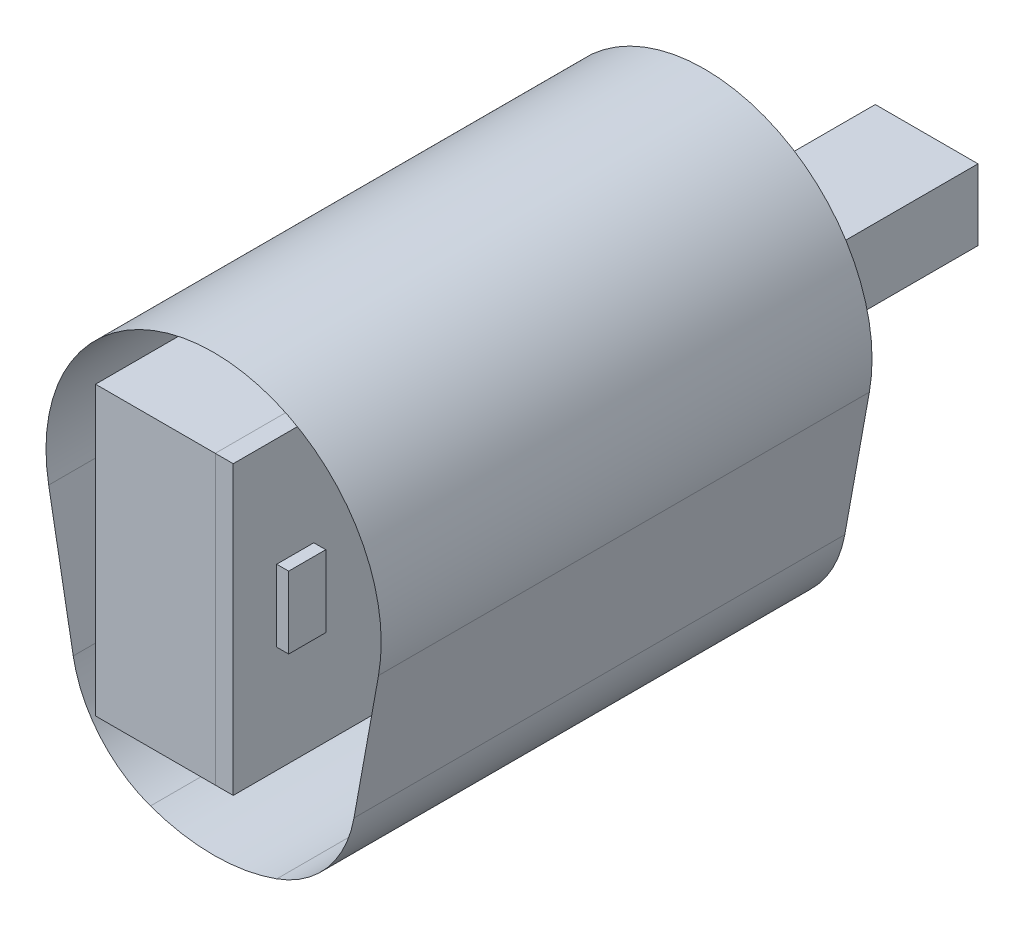
ISO-10303-21;
HEADER;
FILE_DESCRIPTION(('STEP AP214'),'2;1');
FILE_NAME('part.step','',(''),(''),'','','');
FILE_SCHEMA(('AUTOMOTIVE_DESIGN { 1 0 10303 214 1 1 1 1 }'));
ENDSEC;
DATA;
#1=APPLICATION_CONTEXT('core data for automotive mechanical design processes');
#2=APPLICATION_PROTOCOL_DEFINITION('international standard','automotive_design',2000,#1);
#3=PRODUCT_CONTEXT('',#1,'mechanical');
#4=PRODUCT('Part','Part','',(#3));
#5=PRODUCT_RELATED_PRODUCT_CATEGORY('part','',(#4));
#6=PRODUCT_DEFINITION_FORMATION('','',#4);
#7=PRODUCT_DEFINITION_CONTEXT('part definition',#1,'design');
#8=PRODUCT_DEFINITION('design','',#6,#7);
#9=PRODUCT_DEFINITION_SHAPE('','',#8);
#10=(LENGTH_UNIT() NAMED_UNIT(*) SI_UNIT(.MILLI.,.METRE.));
#11=(NAMED_UNIT(*) PLANE_ANGLE_UNIT() SI_UNIT($,.RADIAN.));
#12=(NAMED_UNIT(*) SI_UNIT($,.STERADIAN.) SOLID_ANGLE_UNIT());
#13=UNCERTAINTY_MEASURE_WITH_UNIT(LENGTH_MEASURE(1.E-05),#10,'distance_accuracy_value','');
#14=(GEOMETRIC_REPRESENTATION_CONTEXT(3) GLOBAL_UNCERTAINTY_ASSIGNED_CONTEXT((#13)) GLOBAL_UNIT_ASSIGNED_CONTEXT((#10,
#11,#12)) REPRESENTATION_CONTEXT('',''));
#15=CARTESIAN_POINT('',(0.,0.,0.));
#16=DIRECTION('',(0.,0.,1.));
#17=DIRECTION('',(1.,0.,0.));
#18=AXIS2_PLACEMENT_3D('',#15,#16,#17);
#19=CARTESIAN_POINT('',(5.87335845176571,17.7664865534949,-10.0873183230166));
#20=DIRECTION('',(0.,0.,-1.));
#21=DIRECTION('',(-1.,0.,0.));
#22=AXIS2_PLACEMENT_3D('',#19,#20,#21);
#23=CYLINDRICAL_SURFACE('',#22,5.);
#24=CARTESIAN_POINT('',(5.87335845176571,17.7664865534949,-30.5873183230166));
#25=DIRECTION('',(0.,0.,1.));
#26=DIRECTION('',(-1.,0.,0.));
#27=AXIS2_PLACEMENT_3D('',#24,#25,#26);
#28=CIRCLE('',#27,5.);
#29=CARTESIAN_POINT('',(7.56837223879699,13.06255965549,-30.5873183230166));
#30=VERTEX_POINT('',#29);
#31=CARTESIAN_POINT('',(10.7934731968402,16.8762782097346,-30.5873183230166));
#32=VERTEX_POINT('',#31);
#33=EDGE_CURVE('E56',#30,#32,#28,.T.);
#34=ORIENTED_EDGE('',*,*,#33,.F.);
#35=DIRECTION('',(0.,0.,-1.));
#36=VECTOR('',#35,1.);
#37=CARTESIAN_POINT('',(7.56837223879699,13.06255965549,-10.0873183230166));
#38=LINE('',#37,#36);
#39=CARTESIAN_POINT('',(7.56837223879699,13.06255965549,-10.0873183230166));
#40=VERTEX_POINT('',#39);
#41=EDGE_CURVE('E64',#40,#30,#38,.T.);
#42=ORIENTED_EDGE('',*,*,#41,.F.);
#43=CARTESIAN_POINT('',(5.87335845176571,17.7664865534949,-10.0873183230166));
#44=DIRECTION('',(0.,0.,1.));
#45=DIRECTION('',(-1.,0.,0.));
#46=AXIS2_PLACEMENT_3D('',#43,#44,#45);
#47=CIRCLE('',#46,5.);
#48=CARTESIAN_POINT('',(10.7934731968402,16.8762782097346,-10.0873183230166));
#49=VERTEX_POINT('',#48);
#50=EDGE_CURVE('E12',#40,#49,#47,.T.);
#51=ORIENTED_EDGE('',*,*,#50,.T.);
#52=DIRECTION('',(0.,0.,-1.));
#53=VECTOR('',#52,1.);
#54=CARTESIAN_POINT('',(10.7934731968402,16.8762782097346,-10.0873183230166));
#55=LINE('',#54,#53);
#56=EDGE_CURVE('E50',#49,#32,#55,.T.);
#57=ORIENTED_EDGE('',*,*,#56,.T.);
#58=EDGE_LOOP('',(#34,#42,#51,#57));
#59=FACE_BOUND('',#58,.T.);
#60=ADVANCED_FACE('F48',(#59),#23,.F.);
#61=CARTESIAN_POINT('',(10.7934731968402,16.8762782097346,-10.0873183230166));
#62=DIRECTION('',(-0.984022949014901,0.178041668752059,0.));
#63=DIRECTION('',(-0.178041668752059,-0.984022949014901,0.));
#64=AXIS2_PLACEMENT_3D('',#61,#62,#63);
#65=PLANE('',#64);
#66=DIRECTION('',(0.178041668752059,0.984022949014901,0.));
#67=VECTOR('',#66,1.);
#68=CARTESIAN_POINT('',(10.7934731968402,16.8762782097346,-30.5873183230166));
#69=LINE('',#68,#67);
#70=CARTESIAN_POINT('',(11.8189197951428,22.5438446439957,-30.5873183230166));
#71=VERTEX_POINT('',#70);
#72=EDGE_CURVE('E138',#32,#71,#69,.T.);
#73=ORIENTED_EDGE('',*,*,#72,.F.);
#74=ORIENTED_EDGE('',*,*,#56,.F.);
#75=DIRECTION('',(0.178041668752059,0.984022949014901,0.));
#76=VECTOR('',#75,1.);
#77=CARTESIAN_POINT('',(10.7934731968402,16.8762782097346,-10.0873183230166));
#78=LINE('',#77,#76);
#79=CARTESIAN_POINT('',(11.8189197951428,22.5438446439957,-10.0873183230166));
#80=VERTEX_POINT('',#79);
#81=EDGE_CURVE('E152',#49,#80,#78,.T.);
#82=ORIENTED_EDGE('',*,*,#81,.T.);
#83=DIRECTION('',(0.,0.,-1.));
#84=VECTOR('',#83,1.);
#85=CARTESIAN_POINT('',(11.8189197951428,22.5438446439957,-10.0873183230166));
#86=LINE('',#85,#84);
#87=EDGE_CURVE('E132',#80,#71,#86,.T.);
#88=ORIENTED_EDGE('',*,*,#87,.T.);
#89=EDGE_LOOP('',(#73,#74,#82,#88));
#90=FACE_BOUND('',#89,.T.);
#91=ADVANCED_FACE('F166',(#90),#65,.T.);
#92=CARTESIAN_POINT('',(4.93075915203847,23.7901363252601,-10.0873183230166));
#93=DIRECTION('',(0.,0.,-1.));
#94=DIRECTION('',(-1.,0.,0.));
#95=AXIS2_PLACEMENT_3D('',#92,#93,#94);
#96=CYLINDRICAL_SURFACE('',#95,7.);
#97=CARTESIAN_POINT('',(4.93075915203847,23.7901363252601,-30.5873183230166));
#98=DIRECTION('',(0.,0.,1.));
#99=DIRECTION('',(1.,0.,0.));
#100=AXIS2_PLACEMENT_3D('',#97,#98,#99);
#101=CIRCLE('',#100,7.);
#102=CARTESIAN_POINT('',(-1.95740149106583,22.5438446439957,-30.5873183230166));
#103=VERTEX_POINT('',#102);
#104=EDGE_CURVE('E125',#71,#103,#101,.T.);
#105=ORIENTED_EDGE('',*,*,#104,.F.);
#106=ORIENTED_EDGE('',*,*,#87,.F.);
#107=CARTESIAN_POINT('',(4.93075915203847,23.7901363252601,-10.0873183230166));
#108=DIRECTION('',(0.,0.,1.));
#109=DIRECTION('',(1.,0.,0.));
#110=AXIS2_PLACEMENT_3D('',#107,#108,#109);
#111=CIRCLE('',#110,7.);
#112=CARTESIAN_POINT('',(-1.95740149106583,22.5438446439957,-10.0873183230166));
#113=VERTEX_POINT('',#112);
#114=EDGE_CURVE('E141',#80,#113,#111,.T.);
#115=ORIENTED_EDGE('',*,*,#114,.T.);
#116=DIRECTION('',(0.,0.,-1.));
#117=VECTOR('',#116,1.);
#118=CARTESIAN_POINT('',(-1.95740149106583,22.5438446439957,-10.0873183230166));
#119=LINE('',#118,#117);
#120=EDGE_CURVE('E122',#113,#103,#119,.T.);
#121=ORIENTED_EDGE('',*,*,#120,.T.);
#122=EDGE_LOOP('',(#105,#106,#115,#121));
#123=FACE_BOUND('',#122,.T.);
#124=ADVANCED_FACE('F168',(#123),#96,.F.);
#125=CARTESIAN_POINT('',(-0.931954892763262,16.8762782097346,-10.0873183230166));
#126=DIRECTION('',(0.984022949014901,0.17804166875206,0.));
#127=DIRECTION('',(-0.17804166875206,0.984022949014901,0.));
#128=AXIS2_PLACEMENT_3D('',#125,#126,#127);
#129=PLANE('',#128);
#130=DIRECTION('',(0.17804166875206,-0.984022949014901,0.));
#131=VECTOR('',#130,1.);
#132=CARTESIAN_POINT('',(-0.931954892763262,16.8762782097346,-30.5873183230166));
#133=LINE('',#132,#131);
#134=CARTESIAN_POINT('',(-0.931954892763262,16.8762782097346,-30.5873183230166));
#135=VERTEX_POINT('',#134);
#136=EDGE_CURVE('E117',#103,#135,#133,.T.);
#137=ORIENTED_EDGE('',*,*,#136,.F.);
#138=ORIENTED_EDGE('',*,*,#120,.F.);
#139=DIRECTION('',(0.17804166875206,-0.984022949014901,0.));
#140=VECTOR('',#139,1.);
#141=CARTESIAN_POINT('',(-0.931954892763262,16.8762782097346,-10.0873183230166));
#142=LINE('',#141,#140);
#143=CARTESIAN_POINT('',(-0.931954892763262,16.8762782097346,-10.0873183230166));
#144=VERTEX_POINT('',#143);
#145=EDGE_CURVE('E120',#113,#144,#142,.T.);
#146=ORIENTED_EDGE('',*,*,#145,.T.);
#147=DIRECTION('',(0.,0.,-1.));
#148=VECTOR('',#147,1.);
#149=CARTESIAN_POINT('',(-0.931954892763262,16.8762782097346,-10.0873183230166));
#150=LINE('',#149,#148);
#151=EDGE_CURVE('E105',#144,#135,#150,.T.);
#152=ORIENTED_EDGE('',*,*,#151,.T.);
#153=EDGE_LOOP('',(#137,#138,#146,#152));
#154=FACE_BOUND('',#153,.T.);
#155=ADVANCED_FACE('F121',(#154),#129,.T.);
#156=CARTESIAN_POINT('',(3.98815985231124,17.7664865534949,-10.0873183230166));
#157=DIRECTION('',(0.,0.,-1.));
#158=DIRECTION('',(-1.,0.,0.));
#159=AXIS2_PLACEMENT_3D('',#156,#157,#158);
#160=CYLINDRICAL_SURFACE('',#159,5.);
#161=CARTESIAN_POINT('',(3.98815985231124,17.7664865534949,-30.5873183230166));
#162=DIRECTION('',(0.,0.,1.));
#163=DIRECTION('',(1.,0.,0.));
#164=AXIS2_PLACEMENT_3D('',#161,#162,#163);
#165=CIRCLE('',#164,5.);
#166=CARTESIAN_POINT('',(2.29314606527996,13.06255965549,-30.5873183230166));
#167=VERTEX_POINT('',#166);
#168=EDGE_CURVE('E110',#135,#167,#165,.T.);
#169=ORIENTED_EDGE('',*,*,#168,.F.);
#170=ORIENTED_EDGE('',*,*,#151,.F.);
#171=CARTESIAN_POINT('',(3.98815985231124,17.7664865534949,-10.0873183230166));
#172=DIRECTION('',(0.,0.,1.));
#173=DIRECTION('',(1.,0.,0.));
#174=AXIS2_PLACEMENT_3D('',#171,#172,#173);
#175=CIRCLE('',#174,5.);
#176=CARTESIAN_POINT('',(2.29314606527996,13.06255965549,-10.0873183230166));
#177=VERTEX_POINT('',#176);
#178=EDGE_CURVE('E108',#144,#177,#175,.T.);
#179=ORIENTED_EDGE('',*,*,#178,.T.);
#180=DIRECTION('',(0.,0.,-1.));
#181=VECTOR('',#180,1.);
#182=CARTESIAN_POINT('',(2.29314606527996,13.06255965549,-10.0873183230166));
#183=LINE('',#182,#181);
#184=EDGE_CURVE('E87',#177,#167,#183,.T.);
#185=ORIENTED_EDGE('',*,*,#184,.T.);
#186=EDGE_LOOP('',(#169,#170,#179,#185));
#187=FACE_BOUND('',#186,.T.);
#188=ADVANCED_FACE('F107',(#187),#160,.F.);
#189=CARTESIAN_POINT('',(4.93075915203847,20.3823462202138,-10.0873183230166));
#190=DIRECTION('',(0.,0.,-1.));
#191=DIRECTION('',(-1.,0.,0.));
#192=AXIS2_PLACEMENT_3D('',#189,#190,#191);
#193=CYLINDRICAL_SURFACE('',#192,7.78050629127371);
#194=CARTESIAN_POINT('',(4.93075915203847,20.3823462202138,-30.5873183230166));
#195=DIRECTION('',(0.,0.,1.));
#196=DIRECTION('',(1.,0.,0.));
#197=AXIS2_PLACEMENT_3D('',#194,#195,#196);
#198=CIRCLE('',#197,7.78050629127371);
#199=EDGE_CURVE('E145',#167,#30,#198,.T.);
#200=ORIENTED_EDGE('',*,*,#199,.F.);
#201=ORIENTED_EDGE('',*,*,#184,.F.);
#202=CARTESIAN_POINT('',(4.93075915203847,20.3823462202138,-10.0873183230166));
#203=DIRECTION('',(0.,0.,1.));
#204=DIRECTION('',(1.,0.,0.));
#205=AXIS2_PLACEMENT_3D('',#202,#203,#204);
#206=CIRCLE('',#205,7.78050629127371);
#207=EDGE_CURVE('E136',#177,#40,#206,.T.);
#208=ORIENTED_EDGE('',*,*,#207,.T.);
#209=ORIENTED_EDGE('',*,*,#41,.T.);
#210=EDGE_LOOP('',(#200,#201,#208,#209));
#211=FACE_BOUND('',#210,.T.);
#212=ADVANCED_FACE('F179',(#211),#193,.F.);
#213=OPEN_SHELL('',(#60,#91,#124,#155,#188,#212));
#214=SHELL_BASED_SURFACE_MODEL('B2',(#213));
#215=CARTESIAN_POINT('',(6.25,22.6273289046221,-11.9028565326466));
#216=DIRECTION('',(0.,0.,-1.));
#217=DIRECTION('',(-1.,0.,0.));
#218=AXIS2_PLACEMENT_3D('',#215,#216,#217);
#219=PLANE('',#218);
#220=DIRECTION('',(0.,-1.,0.));
#221=VECTOR('',#220,1.);
#222=CARTESIAN_POINT('',(5.75,22.6273289046221,-11.9028565326466));
#223=LINE('',#222,#221);
#224=CARTESIAN_POINT('',(5.75,22.6273289046221,-11.9028565326466));
#225=VERTEX_POINT('',#224);
#226=CARTESIAN_POINT('',(5.75,19.6273289046221,-11.9028565326466));
#227=VERTEX_POINT('',#226);
#228=EDGE_CURVE('E311',#225,#227,#223,.T.);
#229=ORIENTED_EDGE('',*,*,#228,.T.);
#230=DIRECTION('',(-1.,0.,0.));
#231=VECTOR('',#230,1.);
#232=CARTESIAN_POINT('',(6.25,19.6273289046221,-11.9028565326466));
#233=LINE('',#232,#231);
#234=CARTESIAN_POINT('',(6.25,19.6273289046221,-11.9028565326466));
#235=VERTEX_POINT('',#234);
#236=EDGE_CURVE('E46',#235,#227,#233,.T.);
#237=ORIENTED_EDGE('',*,*,#236,.F.);
#238=DIRECTION('',(0.,-1.,0.));
#239=VECTOR('',#238,1.);
#240=CARTESIAN_POINT('',(6.25,22.6273289046221,-11.9028565326466));
#241=LINE('',#240,#239);
#242=CARTESIAN_POINT('',(6.25,22.6273289046221,-11.9028565326466));
#243=VERTEX_POINT('',#242);
#244=EDGE_CURVE('E299',#243,#235,#241,.T.);
#245=ORIENTED_EDGE('',*,*,#244,.F.);
#246=DIRECTION('',(-1.,0.,0.));
#247=VECTOR('',#246,1.);
#248=CARTESIAN_POINT('',(6.25,22.6273289046221,-11.9028565326466));
#249=LINE('',#248,#247);
#250=EDGE_CURVE('E307',#243,#225,#249,.T.);
#251=ORIENTED_EDGE('',*,*,#250,.T.);
#252=EDGE_LOOP('',(#229,#237,#245,#251));
#253=FACE_BOUND('',#252,.T.);
#254=ADVANCED_FACE('F248',(#253),#219,.F.);
#255=CARTESIAN_POINT('',(6.25,19.6273289046221,-11.9028565326466));
#256=DIRECTION('',(0.,1.,0.));
#257=DIRECTION('',(0.,0.,1.));
#258=AXIS2_PLACEMENT_3D('',#255,#256,#257);
#259=PLANE('',#258);
#260=DIRECTION('',(0.,0.,-1.));
#261=VECTOR('',#260,1.);
#262=CARTESIAN_POINT('',(5.75,19.6273289046221,-11.9028565326466));
#263=LINE('',#262,#261);
#264=CARTESIAN_POINT('',(5.75,19.6273289046221,-13.4528565326466));
#265=VERTEX_POINT('',#264);
#266=EDGE_CURVE('E303',#227,#265,#263,.T.);
#267=ORIENTED_EDGE('',*,*,#266,.T.);
#268=DIRECTION('',(-1.,0.,0.));
#269=VECTOR('',#268,1.);
#270=CARTESIAN_POINT('',(6.25,19.6273289046221,-13.4528565326466));
#271=LINE('',#270,#269);
#272=CARTESIAN_POINT('',(6.25,19.6273289046221,-13.4528565326466));
#273=VERTEX_POINT('',#272);
#274=EDGE_CURVE('E256',#273,#265,#271,.T.);
#275=ORIENTED_EDGE('',*,*,#274,.F.);
#276=DIRECTION('',(0.,0.,-1.));
#277=VECTOR('',#276,1.);
#278=CARTESIAN_POINT('',(6.25,19.6273289046221,-11.9028565326466));
#279=LINE('',#278,#277);
#280=EDGE_CURVE('E294',#235,#273,#279,.T.);
#281=ORIENTED_EDGE('',*,*,#280,.F.);
#282=ORIENTED_EDGE('',*,*,#236,.T.);
#283=EDGE_LOOP('',(#267,#275,#281,#282));
#284=FACE_BOUND('',#283,.T.);
#285=ADVANCED_FACE('F302',(#284),#259,.F.);
#286=CARTESIAN_POINT('',(6.25,22.6273289046221,-13.4528565326466));
#287=DIRECTION('',(0.,0.,1.));
#288=DIRECTION('',(1.,0.,0.));
#289=AXIS2_PLACEMENT_3D('',#286,#287,#288);
#290=PLANE('',#289);
#291=DIRECTION('',(0.,1.,0.));
#292=VECTOR('',#291,1.);
#293=CARTESIAN_POINT('',(5.75,22.6273289046221,-13.4528565326466));
#294=LINE('',#293,#292);
#295=CARTESIAN_POINT('',(5.75,22.6273289046221,-13.4528565326466));
#296=VERTEX_POINT('',#295);
#297=EDGE_CURVE('E281',#265,#296,#294,.T.);
#298=ORIENTED_EDGE('',*,*,#297,.T.);
#299=DIRECTION('',(-1.,0.,0.));
#300=VECTOR('',#299,1.);
#301=CARTESIAN_POINT('',(6.25,22.6273289046221,-13.4528565326466));
#302=LINE('',#301,#300);
#303=CARTESIAN_POINT('',(6.25,22.6273289046221,-13.4528565326466));
#304=VERTEX_POINT('',#303);
#305=EDGE_CURVE('E304',#304,#296,#302,.T.);
#306=ORIENTED_EDGE('',*,*,#305,.F.);
#307=DIRECTION('',(0.,1.,0.));
#308=VECTOR('',#307,1.);
#309=CARTESIAN_POINT('',(6.25,22.6273289046221,-13.4528565326466));
#310=LINE('',#309,#308);
#311=EDGE_CURVE('E297',#273,#304,#310,.T.);
#312=ORIENTED_EDGE('',*,*,#311,.F.);
#313=ORIENTED_EDGE('',*,*,#274,.T.);
#314=EDGE_LOOP('',(#298,#306,#312,#313));
#315=FACE_BOUND('',#314,.T.);
#316=ADVANCED_FACE('F305',(#315),#290,.F.);
#317=CARTESIAN_POINT('',(6.25,22.6273289046221,-11.9028565326466));
#318=DIRECTION('',(0.,-1.,0.));
#319=DIRECTION('',(0.,0.,-1.));
#320=AXIS2_PLACEMENT_3D('',#317,#318,#319);
#321=PLANE('',#320);
#322=DIRECTION('',(0.,0.,1.));
#323=VECTOR('',#322,1.);
#324=CARTESIAN_POINT('',(5.75,22.6273289046221,-11.9028565326466));
#325=LINE('',#324,#323);
#326=EDGE_CURVE('E287',#296,#225,#325,.T.);
#327=ORIENTED_EDGE('',*,*,#326,.T.);
#328=ORIENTED_EDGE('',*,*,#250,.F.);
#329=DIRECTION('',(0.,0.,1.));
#330=VECTOR('',#329,1.);
#331=CARTESIAN_POINT('',(6.25,22.6273289046221,-11.9028565326466));
#332=LINE('',#331,#330);
#333=EDGE_CURVE('E264',#304,#243,#332,.T.);
#334=ORIENTED_EDGE('',*,*,#333,.F.);
#335=ORIENTED_EDGE('',*,*,#305,.T.);
#336=EDGE_LOOP('',(#327,#328,#334,#335));
#337=FACE_BOUND('',#336,.T.);
#338=ADVANCED_FACE('F318',(#337),#321,.F.);
#339=CARTESIAN_POINT('',(6.25,0.,0.));
#340=DIRECTION('',(1.,0.,0.));
#341=DIRECTION('',(0.,0.,-1.));
#342=AXIS2_PLACEMENT_3D('',#339,#340,#341);
#343=PLANE('',#342);
#344=ORIENTED_EDGE('',*,*,#244,.T.);
#345=ORIENTED_EDGE('',*,*,#280,.T.);
#346=ORIENTED_EDGE('',*,*,#311,.T.);
#347=ORIENTED_EDGE('',*,*,#333,.T.);
#348=EDGE_LOOP('',(#344,#345,#346,#347));
#349=FACE_BOUND('',#348,.T.);
#350=ADVANCED_FACE('F295',(#349),#343,.T.);
#351=CARTESIAN_POINT('',(5.75,0.,0.));
#352=DIRECTION('',(1.,0.,0.));
#353=DIRECTION('',(0.,0.,-1.));
#354=AXIS2_PLACEMENT_3D('',#351,#352,#353);
#355=PLANE('',#354);
#356=ORIENTED_EDGE('',*,*,#228,.F.);
#357=ORIENTED_EDGE('',*,*,#326,.F.);
#358=ORIENTED_EDGE('',*,*,#297,.F.);
#359=ORIENTED_EDGE('',*,*,#266,.F.);
#360=EDGE_LOOP('',(#356,#357,#358,#359));
#361=FACE_BOUND('',#360,.T.);
#362=ADVANCED_FACE('F321',(#361),#355,.F.);
#363=CLOSED_SHELL('',(#254,#285,#316,#338,#350,#362));
#364=MANIFOLD_SOLID_BREP('B6',#363);
#365=CARTESIAN_POINT('',(7.75,27.170679999093,-31.0873183230166));
#366=DIRECTION('',(0.,0.,1.));
#367=DIRECTION('',(1.,0.,0.));
#368=AXIS2_PLACEMENT_3D('',#365,#366,#367);
#369=PLANE('',#368);
#370=DIRECTION('',(0.,1.,0.));
#371=VECTOR('',#370,1.);
#372=CARTESIAN_POINT('',(5.75,27.170679999093,-31.0873183230166));
#373=LINE('',#372,#371);
#374=CARTESIAN_POINT('',(5.75,18.270679999093,-31.0873183230166));
#375=VERTEX_POINT('',#374);
#376=CARTESIAN_POINT('',(5.75,27.170679999093,-31.0873183230166));
#377=VERTEX_POINT('',#376);
#378=EDGE_CURVE('E445',#375,#377,#373,.T.);
#379=ORIENTED_EDGE('',*,*,#378,.T.);
#380=DIRECTION('',(-1.,0.,0.));
#381=VECTOR('',#380,1.);
#382=CARTESIAN_POINT('',(7.75,27.170679999093,-31.0873183230166));
#383=LINE('',#382,#381);
#384=CARTESIAN_POINT('',(7.75,27.170679999093,-31.0873183230166));
#385=VERTEX_POINT('',#384);
#386=EDGE_CURVE('E246',#385,#377,#383,.T.);
#387=ORIENTED_EDGE('',*,*,#386,.F.);
#388=DIRECTION('',(0.,1.,0.));
#389=VECTOR('',#388,1.);
#390=CARTESIAN_POINT('',(7.75,27.170679999093,-31.0873183230166));
#391=LINE('',#390,#389);
#392=CARTESIAN_POINT('',(7.75,18.270679999093,-31.0873183230166));
#393=VERTEX_POINT('',#392);
#394=EDGE_CURVE('E433',#393,#385,#391,.T.);
#395=ORIENTED_EDGE('',*,*,#394,.F.);
#396=DIRECTION('',(-1.,0.,0.));
#397=VECTOR('',#396,1.);
#398=CARTESIAN_POINT('',(7.75,18.270679999093,-31.0873183230166));
#399=LINE('',#398,#397);
#400=EDGE_CURVE('E441',#393,#375,#399,.T.);
#401=ORIENTED_EDGE('',*,*,#400,.T.);
#402=EDGE_LOOP('',(#379,#387,#395,#401));
#403=FACE_BOUND('',#402,.T.);
#404=ADVANCED_FACE('F382',(#403),#369,.F.);
#405=CARTESIAN_POINT('',(7.75,27.170679999093,-31.0873183230166));
#406=DIRECTION('',(0.,-1.,0.));
#407=DIRECTION('',(0.,0.,-1.));
#408=AXIS2_PLACEMENT_3D('',#405,#406,#407);
#409=PLANE('',#408);
#410=DIRECTION('',(0.,0.,1.));
#411=VECTOR('',#410,1.);
#412=CARTESIAN_POINT('',(5.75,27.170679999093,-31.0873183230166));
#413=LINE('',#412,#411);
#414=CARTESIAN_POINT('',(5.75,27.170679999093,-18.3873183230166));
#415=VERTEX_POINT('',#414);
#416=EDGE_CURVE('E437',#377,#415,#413,.T.);
#417=ORIENTED_EDGE('',*,*,#416,.T.);
#418=DIRECTION('',(-1.,0.,0.));
#419=VECTOR('',#418,1.);
#420=CARTESIAN_POINT('',(7.75,27.170679999093,-18.3873183230166));
#421=LINE('',#420,#419);
#422=CARTESIAN_POINT('',(7.75,27.170679999093,-18.3873183230166));
#423=VERTEX_POINT('',#422);
#424=EDGE_CURVE('E390',#423,#415,#421,.T.);
#425=ORIENTED_EDGE('',*,*,#424,.F.);
#426=DIRECTION('',(0.,0.,1.));
#427=VECTOR('',#426,1.);
#428=CARTESIAN_POINT('',(7.75,27.170679999093,-31.0873183230166));
#429=LINE('',#428,#427);
#430=EDGE_CURVE('E428',#385,#423,#429,.T.);
#431=ORIENTED_EDGE('',*,*,#430,.F.);
#432=ORIENTED_EDGE('',*,*,#386,.T.);
#433=EDGE_LOOP('',(#417,#425,#431,#432));
#434=FACE_BOUND('',#433,.T.);
#435=ADVANCED_FACE('F436',(#434),#409,.F.);
#436=CARTESIAN_POINT('',(7.75,27.170679999093,-18.3873183230166));
#437=DIRECTION('',(0.,0.,-1.));
#438=DIRECTION('',(-1.,0.,0.));
#439=AXIS2_PLACEMENT_3D('',#436,#437,#438);
#440=PLANE('',#439);
#441=DIRECTION('',(0.,-1.,0.));
#442=VECTOR('',#441,1.);
#443=CARTESIAN_POINT('',(5.75,27.170679999093,-18.3873183230166));
#444=LINE('',#443,#442);
#445=CARTESIAN_POINT('',(5.75,18.270679999093,-18.3873183230166));
#446=VERTEX_POINT('',#445);
#447=EDGE_CURVE('E415',#415,#446,#444,.T.);
#448=ORIENTED_EDGE('',*,*,#447,.T.);
#449=DIRECTION('',(-1.,0.,0.));
#450=VECTOR('',#449,1.);
#451=CARTESIAN_POINT('',(7.75,18.270679999093,-18.3873183230166));
#452=LINE('',#451,#450);
#453=CARTESIAN_POINT('',(7.75,18.270679999093,-18.3873183230166));
#454=VERTEX_POINT('',#453);
#455=EDGE_CURVE('E438',#454,#446,#452,.T.);
#456=ORIENTED_EDGE('',*,*,#455,.F.);
#457=DIRECTION('',(0.,-1.,0.));
#458=VECTOR('',#457,1.);
#459=CARTESIAN_POINT('',(7.75,27.170679999093,-18.3873183230166));
#460=LINE('',#459,#458);
#461=EDGE_CURVE('E431',#423,#454,#460,.T.);
#462=ORIENTED_EDGE('',*,*,#461,.F.);
#463=ORIENTED_EDGE('',*,*,#424,.T.);
#464=EDGE_LOOP('',(#448,#456,#462,#463));
#465=FACE_BOUND('',#464,.T.);
#466=ADVANCED_FACE('F439',(#465),#440,.F.);
#467=CARTESIAN_POINT('',(7.75,18.270679999093,-31.0873183230166));
#468=DIRECTION('',(0.,1.,0.));
#469=DIRECTION('',(0.,0.,1.));
#470=AXIS2_PLACEMENT_3D('',#467,#468,#469);
#471=PLANE('',#470);
#472=DIRECTION('',(0.,0.,-1.));
#473=VECTOR('',#472,1.);
#474=CARTESIAN_POINT('',(5.75,18.270679999093,-31.0873183230166));
#475=LINE('',#474,#473);
#476=EDGE_CURVE('E421',#446,#375,#475,.T.);
#477=ORIENTED_EDGE('',*,*,#476,.T.);
#478=ORIENTED_EDGE('',*,*,#400,.F.);
#479=DIRECTION('',(0.,0.,-1.));
#480=VECTOR('',#479,1.);
#481=CARTESIAN_POINT('',(7.75,18.270679999093,-31.0873183230166));
#482=LINE('',#481,#480);
#483=EDGE_CURVE('E398',#454,#393,#482,.T.);
#484=ORIENTED_EDGE('',*,*,#483,.F.);
#485=ORIENTED_EDGE('',*,*,#455,.T.);
#486=EDGE_LOOP('',(#477,#478,#484,#485));
#487=FACE_BOUND('',#486,.T.);
#488=ADVANCED_FACE('F452',(#487),#471,.F.);
#489=CARTESIAN_POINT('',(7.75,0.,0.));
#490=DIRECTION('',(-1.,0.,0.));
#491=DIRECTION('',(0.,0.,1.));
#492=AXIS2_PLACEMENT_3D('',#489,#490,#491);
#493=PLANE('',#492);
#494=ORIENTED_EDGE('',*,*,#394,.T.);
#495=ORIENTED_EDGE('',*,*,#430,.T.);
#496=ORIENTED_EDGE('',*,*,#461,.T.);
#497=ORIENTED_EDGE('',*,*,#483,.T.);
#498=EDGE_LOOP('',(#494,#495,#496,#497));
#499=FACE_BOUND('',#498,.T.);
#500=ADVANCED_FACE('F429',(#499),#493,.F.);
#501=CARTESIAN_POINT('',(5.75,0.,0.));
#502=DIRECTION('',(-1.,0.,0.));
#503=DIRECTION('',(0.,0.,1.));
#504=AXIS2_PLACEMENT_3D('',#501,#502,#503);
#505=PLANE('',#504);
#506=ORIENTED_EDGE('',*,*,#378,.F.);
#507=ORIENTED_EDGE('',*,*,#476,.F.);
#508=ORIENTED_EDGE('',*,*,#447,.F.);
#509=ORIENTED_EDGE('',*,*,#416,.F.);
#510=EDGE_LOOP('',(#506,#507,#508,#509));
#511=FACE_BOUND('',#510,.T.);
#512=ADVANCED_FACE('F455',(#511),#505,.T.);
#513=CLOSED_SHELL('',(#404,#435,#466,#488,#500,#512));
#514=MANIFOLD_SOLID_BREP('B40',#513);
#515=CARTESIAN_POINT('',(5.75,27.170679999093,-31.0873183230166));
#516=DIRECTION('',(0.,0.,1.));
#517=DIRECTION('',(1.,0.,0.));
#518=AXIS2_PLACEMENT_3D('',#515,#516,#517);
#519=PLANE('',#518);
#520=DIRECTION('',(0.,1.,0.));
#521=VECTOR('',#520,1.);
#522=CARTESIAN_POINT('',(5.,27.170679999093,-31.0873183230166));
#523=LINE('',#522,#521);
#524=CARTESIAN_POINT('',(5.,15.170679999093,-31.0873183230166));
#525=VERTEX_POINT('',#524);
#526=CARTESIAN_POINT('',(5.,27.170679999093,-31.0873183230166));
#527=VERTEX_POINT('',#526);
#528=EDGE_CURVE('E579',#525,#527,#523,.T.);
#529=ORIENTED_EDGE('',*,*,#528,.T.);
#530=DIRECTION('',(-1.,0.,0.));
#531=VECTOR('',#530,1.);
#532=CARTESIAN_POINT('',(5.75,27.170679999093,-31.0873183230166));
#533=LINE('',#532,#531);
#534=CARTESIAN_POINT('',(5.75,27.170679999093,-31.0873183230166));
#535=VERTEX_POINT('',#534);
#536=EDGE_CURVE('E380',#535,#527,#533,.T.);
#537=ORIENTED_EDGE('',*,*,#536,.F.);
#538=DIRECTION('',(0.,1.,0.));
#539=VECTOR('',#538,1.);
#540=CARTESIAN_POINT('',(5.75,27.170679999093,-31.0873183230166));
#541=LINE('',#540,#539);
#542=CARTESIAN_POINT('',(5.75,15.170679999093,-31.0873183230166));
#543=VERTEX_POINT('',#542);
#544=EDGE_CURVE('E567',#543,#535,#541,.T.);
#545=ORIENTED_EDGE('',*,*,#544,.F.);
#546=DIRECTION('',(-1.,0.,0.));
#547=VECTOR('',#546,1.);
#548=CARTESIAN_POINT('',(5.75,15.170679999093,-31.0873183230166));
#549=LINE('',#548,#547);
#550=EDGE_CURVE('E575',#543,#525,#549,.T.);
#551=ORIENTED_EDGE('',*,*,#550,.T.);
#552=EDGE_LOOP('',(#529,#537,#545,#551));
#553=FACE_BOUND('',#552,.T.);
#554=ADVANCED_FACE('F516',(#553),#519,.F.);
#555=CARTESIAN_POINT('',(5.75,27.170679999093,-31.0873183230166));
#556=DIRECTION('',(0.,-1.,0.));
#557=DIRECTION('',(0.,0.,-1.));
#558=AXIS2_PLACEMENT_3D('',#555,#556,#557);
#559=PLANE('',#558);
#560=DIRECTION('',(0.,0.,1.));
#561=VECTOR('',#560,1.);
#562=CARTESIAN_POINT('',(5.,27.170679999093,-31.0873183230166));
#563=LINE('',#562,#561);
#564=CARTESIAN_POINT('',(5.,27.170679999093,-10.0873183230166));
#565=VERTEX_POINT('',#564);
#566=EDGE_CURVE('E571',#527,#565,#563,.T.);
#567=ORIENTED_EDGE('',*,*,#566,.T.);
#568=DIRECTION('',(-1.,0.,0.));
#569=VECTOR('',#568,1.);
#570=CARTESIAN_POINT('',(5.75,27.170679999093,-10.0873183230166));
#571=LINE('',#570,#569);
#572=CARTESIAN_POINT('',(5.75,27.170679999093,-10.0873183230166));
#573=VERTEX_POINT('',#572);
#574=EDGE_CURVE('E524',#573,#565,#571,.T.);
#575=ORIENTED_EDGE('',*,*,#574,.F.);
#576=DIRECTION('',(0.,0.,1.));
#577=VECTOR('',#576,1.);
#578=CARTESIAN_POINT('',(5.75,27.170679999093,-31.0873183230166));
#579=LINE('',#578,#577);
#580=EDGE_CURVE('E562',#535,#573,#579,.T.);
#581=ORIENTED_EDGE('',*,*,#580,.F.);
#582=ORIENTED_EDGE('',*,*,#536,.T.);
#583=EDGE_LOOP('',(#567,#575,#581,#582));
#584=FACE_BOUND('',#583,.T.);
#585=ADVANCED_FACE('F570',(#584),#559,.F.);
#586=CARTESIAN_POINT('',(5.75,27.170679999093,-10.0873183230166));
#587=DIRECTION('',(0.,0.,-1.));
#588=DIRECTION('',(-1.,0.,0.));
#589=AXIS2_PLACEMENT_3D('',#586,#587,#588);
#590=PLANE('',#589);
#591=DIRECTION('',(0.,-1.,0.));
#592=VECTOR('',#591,1.);
#593=CARTESIAN_POINT('',(5.,27.170679999093,-10.0873183230166));
#594=LINE('',#593,#592);
#595=CARTESIAN_POINT('',(5.,15.170679999093,-10.0873183230166));
#596=VERTEX_POINT('',#595);
#597=EDGE_CURVE('E549',#565,#596,#594,.T.);
#598=ORIENTED_EDGE('',*,*,#597,.T.);
#599=DIRECTION('',(-1.,0.,0.));
#600=VECTOR('',#599,1.);
#601=CARTESIAN_POINT('',(5.75,15.170679999093,-10.0873183230166));
#602=LINE('',#601,#600);
#603=CARTESIAN_POINT('',(5.75,15.170679999093,-10.0873183230166));
#604=VERTEX_POINT('',#603);
#605=EDGE_CURVE('E572',#604,#596,#602,.T.);
#606=ORIENTED_EDGE('',*,*,#605,.F.);
#607=DIRECTION('',(0.,-1.,0.));
#608=VECTOR('',#607,1.);
#609=CARTESIAN_POINT('',(5.75,27.170679999093,-10.0873183230166));
#610=LINE('',#609,#608);
#611=EDGE_CURVE('E565',#573,#604,#610,.T.);
#612=ORIENTED_EDGE('',*,*,#611,.F.);
#613=ORIENTED_EDGE('',*,*,#574,.T.);
#614=EDGE_LOOP('',(#598,#606,#612,#613));
#615=FACE_BOUND('',#614,.T.);
#616=ADVANCED_FACE('F573',(#615),#590,.F.);
#617=CARTESIAN_POINT('',(5.75,15.170679999093,-31.0873183230166));
#618=DIRECTION('',(0.,1.,0.));
#619=DIRECTION('',(0.,0.,1.));
#620=AXIS2_PLACEMENT_3D('',#617,#618,#619);
#621=PLANE('',#620);
#622=DIRECTION('',(0.,0.,-1.));
#623=VECTOR('',#622,1.);
#624=CARTESIAN_POINT('',(5.,15.170679999093,-31.0873183230166));
#625=LINE('',#624,#623);
#626=EDGE_CURVE('E555',#596,#525,#625,.T.);
#627=ORIENTED_EDGE('',*,*,#626,.T.);
#628=ORIENTED_EDGE('',*,*,#550,.F.);
#629=DIRECTION('',(0.,0.,-1.));
#630=VECTOR('',#629,1.);
#631=CARTESIAN_POINT('',(5.75,15.170679999093,-31.0873183230166));
#632=LINE('',#631,#630);
#633=EDGE_CURVE('E532',#604,#543,#632,.T.);
#634=ORIENTED_EDGE('',*,*,#633,.F.);
#635=ORIENTED_EDGE('',*,*,#605,.T.);
#636=EDGE_LOOP('',(#627,#628,#634,#635));
#637=FACE_BOUND('',#636,.T.);
#638=ADVANCED_FACE('F586',(#637),#621,.F.);
#639=CARTESIAN_POINT('',(5.75,0.,0.));
#640=DIRECTION('',(-1.,0.,0.));
#641=DIRECTION('',(0.,0.,1.));
#642=AXIS2_PLACEMENT_3D('',#639,#640,#641);
#643=PLANE('',#642);
#644=ORIENTED_EDGE('',*,*,#544,.T.);
#645=ORIENTED_EDGE('',*,*,#580,.T.);
#646=ORIENTED_EDGE('',*,*,#611,.T.);
#647=ORIENTED_EDGE('',*,*,#633,.T.);
#648=EDGE_LOOP('',(#644,#645,#646,#647));
#649=FACE_BOUND('',#648,.T.);
#650=ADVANCED_FACE('F563',(#649),#643,.F.);
#651=CARTESIAN_POINT('',(5.,0.,0.));
#652=DIRECTION('',(-1.,0.,0.));
#653=DIRECTION('',(0.,0.,1.));
#654=AXIS2_PLACEMENT_3D('',#651,#652,#653);
#655=PLANE('',#654);
#656=ORIENTED_EDGE('',*,*,#528,.F.);
#657=ORIENTED_EDGE('',*,*,#626,.F.);
#658=ORIENTED_EDGE('',*,*,#597,.F.);
#659=ORIENTED_EDGE('',*,*,#566,.F.);
#660=EDGE_LOOP('',(#656,#657,#658,#659));
#661=FACE_BOUND('',#660,.T.);
#662=ADVANCED_FACE('F589',(#661),#655,.T.);
#663=CLOSED_SHELL('',(#554,#585,#616,#638,#650,#662));
#664=MANIFOLD_SOLID_BREP('B240',#663);
#665=CARTESIAN_POINT('',(2.78575915203847,20.8301363252601,-39.8673183230166));
#666=DIRECTION('',(1.,0.,0.));
#667=DIRECTION('',(0.,0.,-1.));
#668=AXIS2_PLACEMENT_3D('',#665,#666,#667);
#669=PLANE('',#668);
#670=DIRECTION('',(0.,1.,0.));
#671=VECTOR('',#670,1.);
#672=CARTESIAN_POINT('',(2.78575915203847,20.8301363252601,-33.0073183230166));
#673=LINE('',#672,#671);
#674=CARTESIAN_POINT('',(2.78575915203847,20.8301363252601,-33.0073183230166));
#675=VERTEX_POINT('',#674);
#676=CARTESIAN_POINT('',(2.78575915203847,23.7901363252601,-33.0073183230166));
#677=VERTEX_POINT('',#676);
#678=EDGE_CURVE('E712',#675,#677,#673,.T.);
#679=ORIENTED_EDGE('',*,*,#678,.T.);
#680=DIRECTION('',(0.,0.,1.));
#681=VECTOR('',#680,1.);
#682=CARTESIAN_POINT('',(2.78575915203847,23.7901363252601,-39.8673183230166));
#683=LINE('',#682,#681);
#684=CARTESIAN_POINT('',(2.78575915203847,23.7901363252601,-39.8673183230166));
#685=VERTEX_POINT('',#684);
#686=EDGE_CURVE('E514',#685,#677,#683,.T.);
#687=ORIENTED_EDGE('',*,*,#686,.F.);
#688=DIRECTION('',(0.,1.,0.));
#689=VECTOR('',#688,1.);
#690=CARTESIAN_POINT('',(2.78575915203847,20.8301363252601,-39.8673183230166));
#691=LINE('',#690,#689);
#692=CARTESIAN_POINT('',(2.78575915203847,20.8301363252601,-39.8673183230166));
#693=VERTEX_POINT('',#692);
#694=EDGE_CURVE('E700',#693,#685,#691,.T.);
#695=ORIENTED_EDGE('',*,*,#694,.F.);
#696=DIRECTION('',(0.,0.,1.));
#697=VECTOR('',#696,1.);
#698=CARTESIAN_POINT('',(2.78575915203847,20.8301363252601,-39.8673183230166));
#699=LINE('',#698,#697);
#700=EDGE_CURVE('E708',#693,#675,#699,.T.);
#701=ORIENTED_EDGE('',*,*,#700,.T.);
#702=EDGE_LOOP('',(#679,#687,#695,#701));
#703=FACE_BOUND('',#702,.T.);
#704=ADVANCED_FACE('F649',(#703),#669,.F.);
#705=CARTESIAN_POINT('',(2.78575915203847,23.7901363252601,-39.8673183230166));
#706=DIRECTION('',(0.,-1.,0.));
#707=DIRECTION('',(0.,0.,-1.));
#708=AXIS2_PLACEMENT_3D('',#705,#706,#707);
#709=PLANE('',#708);
#710=DIRECTION('',(1.,0.,0.));
#711=VECTOR('',#710,1.);
#712=CARTESIAN_POINT('',(2.78575915203847,23.7901363252601,-33.0073183230166));
#713=LINE('',#712,#711);
#714=CARTESIAN_POINT('',(7.07575915203847,23.7901363252601,-33.0073183230166));
#715=VERTEX_POINT('',#714);
#716=EDGE_CURVE('E704',#677,#715,#713,.T.);
#717=ORIENTED_EDGE('',*,*,#716,.T.);
#718=DIRECTION('',(0.,0.,1.));
#719=VECTOR('',#718,1.);
#720=CARTESIAN_POINT('',(7.07575915203847,23.7901363252601,-39.8673183230166));
#721=LINE('',#720,#719);
#722=CARTESIAN_POINT('',(7.07575915203847,23.7901363252601,-39.8673183230166));
#723=VERTEX_POINT('',#722);
#724=EDGE_CURVE('E657',#723,#715,#721,.T.);
#725=ORIENTED_EDGE('',*,*,#724,.F.);
#726=DIRECTION('',(1.,0.,0.));
#727=VECTOR('',#726,1.);
#728=CARTESIAN_POINT('',(2.78575915203847,23.7901363252601,-39.8673183230166));
#729=LINE('',#728,#727);
#730=EDGE_CURVE('E695',#685,#723,#729,.T.);
#731=ORIENTED_EDGE('',*,*,#730,.F.);
#732=ORIENTED_EDGE('',*,*,#686,.T.);
#733=EDGE_LOOP('',(#717,#725,#731,#732));
#734=FACE_BOUND('',#733,.T.);
#735=ADVANCED_FACE('F703',(#734),#709,.F.);
#736=CARTESIAN_POINT('',(7.07575915203847,20.8301363252601,-39.8673183230166));
#737=DIRECTION('',(-1.,0.,0.));
#738=DIRECTION('',(0.,0.,1.));
#739=AXIS2_PLACEMENT_3D('',#736,#737,#738);
#740=PLANE('',#739);
#741=DIRECTION('',(0.,-1.,0.));
#742=VECTOR('',#741,1.);
#743=CARTESIAN_POINT('',(7.07575915203847,20.8301363252601,-33.0073183230166));
#744=LINE('',#743,#742);
#745=CARTESIAN_POINT('',(7.07575915203847,20.8301363252601,-33.0073183230166));
#746=VERTEX_POINT('',#745);
#747=EDGE_CURVE('E682',#715,#746,#744,.T.);
#748=ORIENTED_EDGE('',*,*,#747,.T.);
#749=DIRECTION('',(0.,0.,1.));
#750=VECTOR('',#749,1.);
#751=CARTESIAN_POINT('',(7.07575915203847,20.8301363252601,-39.8673183230166));
#752=LINE('',#751,#750);
#753=CARTESIAN_POINT('',(7.07575915203847,20.8301363252601,-39.8673183230166));
#754=VERTEX_POINT('',#753);
#755=EDGE_CURVE('E705',#754,#746,#752,.T.);
#756=ORIENTED_EDGE('',*,*,#755,.F.);
#757=DIRECTION('',(0.,-1.,0.));
#758=VECTOR('',#757,1.);
#759=CARTESIAN_POINT('',(7.07575915203847,20.8301363252601,-39.8673183230166));
#760=LINE('',#759,#758);
#761=EDGE_CURVE('E698',#723,#754,#760,.T.);
#762=ORIENTED_EDGE('',*,*,#761,.F.);
#763=ORIENTED_EDGE('',*,*,#724,.T.);
#764=EDGE_LOOP('',(#748,#756,#762,#763));
#765=FACE_BOUND('',#764,.T.);
#766=ADVANCED_FACE('F706',(#765),#740,.F.);
#767=CARTESIAN_POINT('',(2.78575915203847,20.8301363252601,-39.8673183230166));
#768=DIRECTION('',(0.,1.,0.));
#769=DIRECTION('',(0.,0.,1.));
#770=AXIS2_PLACEMENT_3D('',#767,#768,#769);
#771=PLANE('',#770);
#772=DIRECTION('',(-1.,0.,0.));
#773=VECTOR('',#772,1.);
#774=CARTESIAN_POINT('',(2.78575915203847,20.8301363252601,-33.0073183230166));
#775=LINE('',#774,#773);
#776=EDGE_CURVE('E688',#746,#675,#775,.T.);
#777=ORIENTED_EDGE('',*,*,#776,.T.);
#778=ORIENTED_EDGE('',*,*,#700,.F.);
#779=DIRECTION('',(-1.,0.,0.));
#780=VECTOR('',#779,1.);
#781=CARTESIAN_POINT('',(2.78575915203847,20.8301363252601,-39.8673183230166));
#782=LINE('',#781,#780);
#783=EDGE_CURVE('E665',#754,#693,#782,.T.);
#784=ORIENTED_EDGE('',*,*,#783,.F.);
#785=ORIENTED_EDGE('',*,*,#755,.T.);
#786=EDGE_LOOP('',(#777,#778,#784,#785));
#787=FACE_BOUND('',#786,.T.);
#788=ADVANCED_FACE('F719',(#787),#771,.F.);
#789=CARTESIAN_POINT('',(0.,0.,-39.8673183230166));
#790=DIRECTION('',(0.,0.,-1.));
#791=DIRECTION('',(-1.,0.,0.));
#792=AXIS2_PLACEMENT_3D('',#789,#790,#791);
#793=PLANE('',#792);
#794=ORIENTED_EDGE('',*,*,#694,.T.);
#795=ORIENTED_EDGE('',*,*,#730,.T.);
#796=ORIENTED_EDGE('',*,*,#761,.T.);
#797=ORIENTED_EDGE('',*,*,#783,.T.);
#798=EDGE_LOOP('',(#794,#795,#796,#797));
#799=FACE_BOUND('',#798,.T.);
#800=ADVANCED_FACE('F696',(#799),#793,.T.);
#801=CARTESIAN_POINT('',(0.,0.,-33.0073183230166));
#802=DIRECTION('',(0.,0.,-1.));
#803=DIRECTION('',(-1.,0.,0.));
#804=AXIS2_PLACEMENT_3D('',#801,#802,#803);
#805=PLANE('',#804);
#806=ORIENTED_EDGE('',*,*,#678,.F.);
#807=ORIENTED_EDGE('',*,*,#776,.F.);
#808=ORIENTED_EDGE('',*,*,#747,.F.);
#809=ORIENTED_EDGE('',*,*,#716,.F.);
#810=EDGE_LOOP('',(#806,#807,#808,#809));
#811=FACE_BOUND('',#810,.T.);
#812=ADVANCED_FACE('F722',(#811),#805,.F.);
#813=CLOSED_SHELL('',(#704,#735,#766,#788,#800,#812));
#814=MANIFOLD_SOLID_BREP('B374',#813);
#815=CARTESIAN_POINT('',(5.,15.170679999093,-10.0873183230166));
#816=DIRECTION('',(0.,0.,-1.));
#817=DIRECTION('',(-1.,0.,0.));
#818=AXIS2_PLACEMENT_3D('',#815,#816,#817);
#819=PLANE('',#818);
#820=DIRECTION('',(0.,-1.,0.));
#821=VECTOR('',#820,1.);
#822=CARTESIAN_POINT('',(0.,15.170679999093,-10.0873183230166));
#823=LINE('',#822,#821);
#824=CARTESIAN_POINT('',(0.,27.170679999093,-10.0873183230166));
#825=VERTEX_POINT('',#824);
#826=CARTESIAN_POINT('',(0.,15.170679999093,-10.0873183230166));
#827=VERTEX_POINT('',#826);
#828=EDGE_CURVE('E836',#825,#827,#823,.T.);
#829=ORIENTED_EDGE('',*,*,#828,.T.);
#830=DIRECTION('',(-1.,0.,0.));
#831=VECTOR('',#830,1.);
#832=CARTESIAN_POINT('',(5.,15.170679999093,-10.0873183230166));
#833=LINE('',#832,#831);
#834=CARTESIAN_POINT('',(5.,15.170679999093,-10.0873183230166));
#835=VERTEX_POINT('',#834);
#836=EDGE_CURVE('E647',#835,#827,#833,.T.);
#837=ORIENTED_EDGE('',*,*,#836,.F.);
#838=DIRECTION('',(0.,-1.,0.));
#839=VECTOR('',#838,1.);
#840=CARTESIAN_POINT('',(5.,15.170679999093,-10.0873183230166));
#841=LINE('',#840,#839);
#842=CARTESIAN_POINT('',(5.,27.170679999093,-10.0873183230166));
#843=VERTEX_POINT('',#842);
#844=EDGE_CURVE('E824',#843,#835,#841,.T.);
#845=ORIENTED_EDGE('',*,*,#844,.F.);
#846=DIRECTION('',(-1.,0.,0.));
#847=VECTOR('',#846,1.);
#848=CARTESIAN_POINT('',(5.,27.170679999093,-10.0873183230166));
#849=LINE('',#848,#847);
#850=EDGE_CURVE('E832',#843,#825,#849,.T.);
#851=ORIENTED_EDGE('',*,*,#850,.T.);
#852=EDGE_LOOP('',(#829,#837,#845,#851));
#853=FACE_BOUND('',#852,.T.);
#854=ADVANCED_FACE('F773',(#853),#819,.F.);
#855=CARTESIAN_POINT('',(5.,15.170679999093,-10.0873183230166));
#856=DIRECTION('',(0.,1.,0.));
#857=DIRECTION('',(0.,0.,1.));
#858=AXIS2_PLACEMENT_3D('',#855,#856,#857);
#859=PLANE('',#858);
#860=DIRECTION('',(0.,0.,-1.));
#861=VECTOR('',#860,1.);
#862=CARTESIAN_POINT('',(0.,15.170679999093,-10.0873183230166));
#863=LINE('',#862,#861);
#864=CARTESIAN_POINT('',(0.,15.170679999093,-31.0873183230166));
#865=VERTEX_POINT('',#864);
#866=EDGE_CURVE('E828',#827,#865,#863,.T.);
#867=ORIENTED_EDGE('',*,*,#866,.T.);
#868=DIRECTION('',(-1.,0.,0.));
#869=VECTOR('',#868,1.);
#870=CARTESIAN_POINT('',(5.,15.170679999093,-31.0873183230166));
#871=LINE('',#870,#869);
#872=CARTESIAN_POINT('',(5.,15.170679999093,-31.0873183230166));
#873=VERTEX_POINT('',#872);
#874=EDGE_CURVE('E781',#873,#865,#871,.T.);
#875=ORIENTED_EDGE('',*,*,#874,.F.);
#876=DIRECTION('',(0.,0.,-1.));
#877=VECTOR('',#876,1.);
#878=CARTESIAN_POINT('',(5.,15.170679999093,-10.0873183230166));
#879=LINE('',#878,#877);
#880=EDGE_CURVE('E819',#835,#873,#879,.T.);
#881=ORIENTED_EDGE('',*,*,#880,.F.);
#882=ORIENTED_EDGE('',*,*,#836,.T.);
#883=EDGE_LOOP('',(#867,#875,#881,#882));
#884=FACE_BOUND('',#883,.T.);
#885=ADVANCED_FACE('F827',(#884),#859,.F.);
#886=CARTESIAN_POINT('',(5.,15.170679999093,-31.0873183230166));
#887=DIRECTION('',(0.,0.,1.));
#888=DIRECTION('',(1.,0.,0.));
#889=AXIS2_PLACEMENT_3D('',#886,#887,#888);
#890=PLANE('',#889);
#891=DIRECTION('',(0.,1.,0.));
#892=VECTOR('',#891,1.);
#893=CARTESIAN_POINT('',(0.,15.170679999093,-31.0873183230166));
#894=LINE('',#893,#892);
#895=CARTESIAN_POINT('',(0.,27.170679999093,-31.0873183230166));
#896=VERTEX_POINT('',#895);
#897=EDGE_CURVE('E806',#865,#896,#894,.T.);
#898=ORIENTED_EDGE('',*,*,#897,.T.);
#899=DIRECTION('',(-1.,0.,0.));
#900=VECTOR('',#899,1.);
#901=CARTESIAN_POINT('',(5.,27.170679999093,-31.0873183230166));
#902=LINE('',#901,#900);
#903=CARTESIAN_POINT('',(5.,27.170679999093,-31.0873183230166));
#904=VERTEX_POINT('',#903);
#905=EDGE_CURVE('E829',#904,#896,#902,.T.);
#906=ORIENTED_EDGE('',*,*,#905,.F.);
#907=DIRECTION('',(0.,1.,0.));
#908=VECTOR('',#907,1.);
#909=CARTESIAN_POINT('',(5.,15.170679999093,-31.0873183230166));
#910=LINE('',#909,#908);
#911=EDGE_CURVE('E822',#873,#904,#910,.T.);
#912=ORIENTED_EDGE('',*,*,#911,.F.);
#913=ORIENTED_EDGE('',*,*,#874,.T.);
#914=EDGE_LOOP('',(#898,#906,#912,#913));
#915=FACE_BOUND('',#914,.T.);
#916=ADVANCED_FACE('F830',(#915),#890,.F.);
#917=CARTESIAN_POINT('',(5.,27.170679999093,-10.0873183230166));
#918=DIRECTION('',(0.,-1.,0.));
#919=DIRECTION('',(0.,0.,-1.));
#920=AXIS2_PLACEMENT_3D('',#917,#918,#919);
#921=PLANE('',#920);
#922=DIRECTION('',(0.,0.,1.));
#923=VECTOR('',#922,1.);
#924=CARTESIAN_POINT('',(0.,27.170679999093,-10.0873183230166));
#925=LINE('',#924,#923);
#926=EDGE_CURVE('E812',#896,#825,#925,.T.);
#927=ORIENTED_EDGE('',*,*,#926,.T.);
#928=ORIENTED_EDGE('',*,*,#850,.F.);
#929=DIRECTION('',(0.,0.,1.));
#930=VECTOR('',#929,1.);
#931=CARTESIAN_POINT('',(5.,27.170679999093,-10.0873183230166));
#932=LINE('',#931,#930);
#933=EDGE_CURVE('E789',#904,#843,#932,.T.);
#934=ORIENTED_EDGE('',*,*,#933,.F.);
#935=ORIENTED_EDGE('',*,*,#905,.T.);
#936=EDGE_LOOP('',(#927,#928,#934,#935));
#937=FACE_BOUND('',#936,.T.);
#938=ADVANCED_FACE('F843',(#937),#921,.F.);
#939=CARTESIAN_POINT('',(5.,0.,0.));
#940=DIRECTION('',(-1.,0.,0.));
#941=DIRECTION('',(0.,0.,1.));
#942=AXIS2_PLACEMENT_3D('',#939,#940,#941);
#943=PLANE('',#942);
#944=ORIENTED_EDGE('',*,*,#844,.T.);
#945=ORIENTED_EDGE('',*,*,#880,.T.);
#946=ORIENTED_EDGE('',*,*,#911,.T.);
#947=ORIENTED_EDGE('',*,*,#933,.T.);
#948=EDGE_LOOP('',(#944,#945,#946,#947));
#949=FACE_BOUND('',#948,.T.);
#950=ADVANCED_FACE('F820',(#949),#943,.F.);
#951=CARTESIAN_POINT('',(0.,0.,0.));
#952=DIRECTION('',(-1.,0.,0.));
#953=DIRECTION('',(0.,0.,1.));
#954=AXIS2_PLACEMENT_3D('',#951,#952,#953);
#955=PLANE('',#954);
#956=ORIENTED_EDGE('',*,*,#828,.F.);
#957=ORIENTED_EDGE('',*,*,#926,.F.);
#958=ORIENTED_EDGE('',*,*,#897,.F.);
#959=ORIENTED_EDGE('',*,*,#866,.F.);
#960=EDGE_LOOP('',(#956,#957,#958,#959));
#961=FACE_BOUND('',#960,.T.);
#962=ADVANCED_FACE('F846',(#961),#955,.T.);
#963=CLOSED_SHELL('',(#854,#885,#916,#938,#950,#962));
#964=MANIFOLD_SOLID_BREP('B508',#963);
#965=ADVANCED_BREP_SHAPE_REPRESENTATION('',(#18,#364,#514,#664,#814,#964),#14);
#966=MANIFOLD_SURFACE_SHAPE_REPRESENTATION('',(#18,#214),#14);
#967=SHAPE_REPRESENTATION('',(#18),#14);
#968=SHAPE_DEFINITION_REPRESENTATION(#9,#967);
#969=SHAPE_REPRESENTATION_RELATIONSHIP('','',#967,#965);
#970=SHAPE_REPRESENTATION_RELATIONSHIP('','',#967,#966);
ENDSEC;
END-ISO-10303-21;
